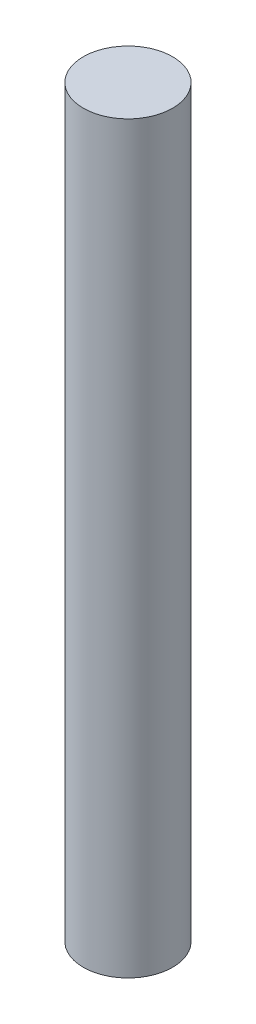
ISO-10303-21;
HEADER;
FILE_DESCRIPTION(('STEP AP214'),'2;1');
FILE_NAME('part.step','',(''),(''),'','','');
FILE_SCHEMA(('AUTOMOTIVE_DESIGN { 1 0 10303 214 1 1 1 1 }'));
ENDSEC;
DATA;
#1=APPLICATION_CONTEXT('core data for automotive mechanical design processes');
#2=APPLICATION_PROTOCOL_DEFINITION('international standard','automotive_design',2000,#1);
#3=PRODUCT_CONTEXT('',#1,'mechanical');
#4=PRODUCT('Part','Part','',(#3));
#5=PRODUCT_RELATED_PRODUCT_CATEGORY('part','',(#4));
#6=PRODUCT_DEFINITION_FORMATION('','',#4);
#7=PRODUCT_DEFINITION_CONTEXT('part definition',#1,'design');
#8=PRODUCT_DEFINITION('design','',#6,#7);
#9=PRODUCT_DEFINITION_SHAPE('','',#8);
#10=(LENGTH_UNIT() NAMED_UNIT(*) SI_UNIT(.MILLI.,.METRE.));
#11=(NAMED_UNIT(*) PLANE_ANGLE_UNIT() SI_UNIT($,.RADIAN.));
#12=(NAMED_UNIT(*) SI_UNIT($,.STERADIAN.) SOLID_ANGLE_UNIT());
#13=UNCERTAINTY_MEASURE_WITH_UNIT(LENGTH_MEASURE(1.E-05),#10,'distance_accuracy_value','');
#14=(GEOMETRIC_REPRESENTATION_CONTEXT(3) GLOBAL_UNCERTAINTY_ASSIGNED_CONTEXT((#13)) GLOBAL_UNIT_ASSIGNED_CONTEXT((#10,
#11,#12)) REPRESENTATION_CONTEXT('',''));
#15=CARTESIAN_POINT('',(0.,0.,0.));
#16=DIRECTION('',(0.,0.,1.));
#17=DIRECTION('',(1.,0.,0.));
#18=AXIS2_PLACEMENT_3D('',#15,#16,#17);
#19=CARTESIAN_POINT('',(0.,158.75,0.));
#20=DIRECTION('',(0.,-1.,0.));
#21=DIRECTION('',(0.,0.,-1.));
#22=AXIS2_PLACEMENT_3D('',#19,#20,#21);
#23=CYLINDRICAL_SURFACE('',#22,9.525);
#24=CARTESIAN_POINT('',(0.,158.75,0.));
#25=DIRECTION('',(0.,1.,0.));
#26=DIRECTION('',(0.,0.,1.));
#27=AXIS2_PLACEMENT_3D('',#24,#25,#26);
#28=CIRCLE('',#27,9.525);
#29=CARTESIAN_POINT('',(0.,158.75,9.525));
#30=VERTEX_POINT('',#29);
#31=EDGE_CURVE('E10',#30,#30,#28,.T.);
#32=ORIENTED_EDGE('',*,*,#31,.F.);
#33=EDGE_LOOP('',(#32));
#34=FACE_BOUND('',#33,.T.);
#35=CARTESIAN_POINT('',(0.,0.,0.));
#36=DIRECTION('',(0.,1.,0.));
#37=DIRECTION('',(0.,0.,1.));
#38=AXIS2_PLACEMENT_3D('',#35,#36,#37);
#39=CIRCLE('',#38,9.525);
#40=CARTESIAN_POINT('',(0.,0.,9.525));
#41=VERTEX_POINT('',#40);
#42=EDGE_CURVE('E18',#41,#41,#39,.T.);
#43=ORIENTED_EDGE('',*,*,#42,.T.);
#44=EDGE_LOOP('',(#43));
#45=FACE_BOUND('',#44,.T.);
#46=ADVANCED_FACE('F15',(#34,#45),#23,.T.);
#47=CARTESIAN_POINT('',(0.,158.75,0.));
#48=DIRECTION('',(0.,1.,0.));
#49=DIRECTION('',(0.,0.,1.));
#50=AXIS2_PLACEMENT_3D('',#47,#48,#49);
#51=PLANE('',#50);
#52=ORIENTED_EDGE('',*,*,#31,.T.);
#53=EDGE_LOOP('',(#52));
#54=FACE_BOUND('',#53,.T.);
#55=ADVANCED_FACE('F30',(#54),#51,.T.);
#56=CARTESIAN_POINT('',(0.,0.,0.));
#57=DIRECTION('',(0.,1.,0.));
#58=DIRECTION('',(0.,0.,1.));
#59=AXIS2_PLACEMENT_3D('',#56,#57,#58);
#60=PLANE('',#59);
#61=ORIENTED_EDGE('',*,*,#42,.F.);
#62=EDGE_LOOP('',(#61));
#63=FACE_BOUND('',#62,.T.);
#64=ADVANCED_FACE('F28',(#63),#60,.F.);
#65=CLOSED_SHELL('',(#46,#55,#64));
#66=MANIFOLD_SOLID_BREP('B1',#65);
#67=ADVANCED_BREP_SHAPE_REPRESENTATION('',(#18,#66),#14);
#68=SHAPE_DEFINITION_REPRESENTATION(#9,#67);
ENDSEC;
END-ISO-10303-21;
